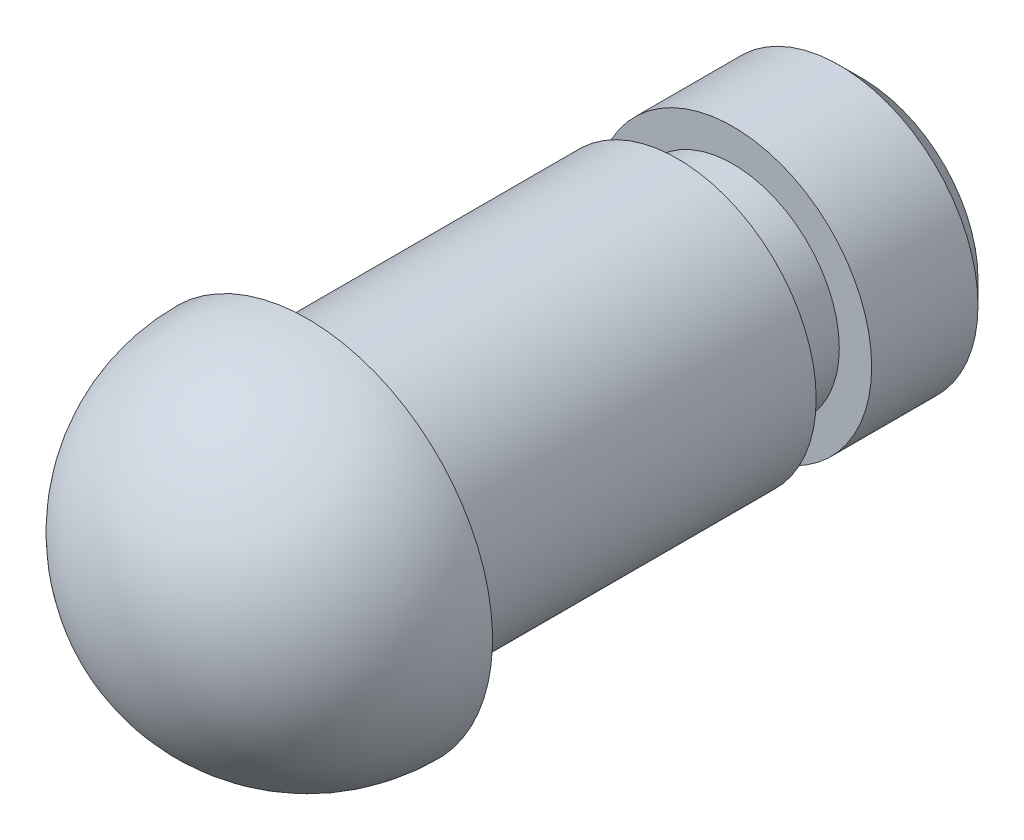
ISO-10303-21;
HEADER;
FILE_DESCRIPTION(('STEP AP214'),'2;1');
FILE_NAME('part.step','',(''),(''),'','','');
FILE_SCHEMA(('AUTOMOTIVE_DESIGN { 1 0 10303 214 1 1 1 1 }'));
ENDSEC;
DATA;
#1=APPLICATION_CONTEXT('core data for automotive mechanical design processes');
#2=APPLICATION_PROTOCOL_DEFINITION('international standard','automotive_design',2000,#1);
#3=PRODUCT_CONTEXT('',#1,'mechanical');
#4=PRODUCT('Part','Part','',(#3));
#5=PRODUCT_RELATED_PRODUCT_CATEGORY('part','',(#4));
#6=PRODUCT_DEFINITION_FORMATION('','',#4);
#7=PRODUCT_DEFINITION_CONTEXT('part definition',#1,'design');
#8=PRODUCT_DEFINITION('design','',#6,#7);
#9=PRODUCT_DEFINITION_SHAPE('','',#8);
#10=(LENGTH_UNIT() NAMED_UNIT(*) SI_UNIT(.MILLI.,.METRE.));
#11=(NAMED_UNIT(*) PLANE_ANGLE_UNIT() SI_UNIT($,.RADIAN.));
#12=(NAMED_UNIT(*) SI_UNIT($,.STERADIAN.) SOLID_ANGLE_UNIT());
#13=UNCERTAINTY_MEASURE_WITH_UNIT(LENGTH_MEASURE(1.E-05),#10,'distance_accuracy_value','');
#14=(GEOMETRIC_REPRESENTATION_CONTEXT(3) GLOBAL_UNCERTAINTY_ASSIGNED_CONTEXT((#13)) GLOBAL_UNIT_ASSIGNED_CONTEXT((#10,
#11,#12)) REPRESENTATION_CONTEXT('',''));
#15=CARTESIAN_POINT('',(0.,0.,0.));
#16=DIRECTION('',(0.,0.,1.));
#17=DIRECTION('',(1.,0.,0.));
#18=AXIS2_PLACEMENT_3D('',#15,#16,#17);
#19=CARTESIAN_POINT('',(0.,0.,1.4));
#20=DIRECTION('',(0.,0.,-1.));
#21=DIRECTION('',(-1.,0.,0.));
#22=AXIS2_PLACEMENT_3D('',#19,#20,#21);
#23=CYLINDRICAL_SURFACE('',#22,1.5);
#24=CARTESIAN_POINT('',(0.,0.,0.25));
#25=DIRECTION('',(0.,0.,1.));
#26=DIRECTION('',(1.,0.,0.));
#27=AXIS2_PLACEMENT_3D('',#24,#25,#26);
#28=CIRCLE('',#27,1.5);
#29=CARTESIAN_POINT('',(1.5,0.,0.25));
#30=VERTEX_POINT('',#29);
#31=EDGE_CURVE('E63',#30,#30,#28,.T.);
#32=ORIENTED_EDGE('',*,*,#31,.T.);
#33=EDGE_LOOP('',(#32));
#34=FACE_BOUND('',#33,.T.);
#35=CARTESIAN_POINT('',(0.,0.,1.4));
#36=DIRECTION('',(0.,0.,1.));
#37=DIRECTION('',(1.,0.,0.));
#38=AXIS2_PLACEMENT_3D('',#35,#36,#37);
#39=CIRCLE('',#38,1.5);
#40=CARTESIAN_POINT('',(1.5,0.,1.4));
#41=VERTEX_POINT('',#40);
#42=EDGE_CURVE('E75',#41,#41,#39,.T.);
#43=ORIENTED_EDGE('',*,*,#42,.F.);
#44=EDGE_LOOP('',(#43));
#45=FACE_BOUND('',#44,.T.);
#46=ADVANCED_FACE('F54',(#34,#45),#23,.T.);
#47=CARTESIAN_POINT('',(0.,0.,1.4));
#48=DIRECTION('',(0.,0.,1.));
#49=DIRECTION('',(1.,0.,0.));
#50=AXIS2_PLACEMENT_3D('',#47,#48,#49);
#51=PLANE('',#50);
#52=CARTESIAN_POINT('',(0.,0.,1.4));
#53=DIRECTION('',(0.,0.,1.));
#54=DIRECTION('',(1.,0.,0.));
#55=AXIS2_PLACEMENT_3D('',#52,#53,#54);
#56=CIRCLE('',#55,1.15);
#57=CARTESIAN_POINT('',(1.15,0.,1.4));
#58=VERTEX_POINT('',#57);
#59=EDGE_CURVE('E69',#58,#58,#56,.T.);
#60=ORIENTED_EDGE('',*,*,#59,.F.);
#61=EDGE_LOOP('',(#60));
#62=FACE_BOUND('',#61,.T.);
#63=ORIENTED_EDGE('',*,*,#42,.T.);
#64=EDGE_LOOP('',(#63));
#65=FACE_BOUND('',#64,.T.);
#66=ADVANCED_FACE('F115',(#62,#65),#51,.T.);
#67=CARTESIAN_POINT('',(0.,0.,0.));
#68=DIRECTION('',(0.,0.,1.));
#69=DIRECTION('',(1.,0.,0.));
#70=AXIS2_PLACEMENT_3D('',#67,#68,#69);
#71=PLANE('',#70);
#72=CARTESIAN_POINT('',(0.,0.,0.));
#73=DIRECTION('',(0.,0.,1.));
#74=DIRECTION('',(1.,0.,0.));
#75=AXIS2_PLACEMENT_3D('',#72,#73,#74);
#76=CIRCLE('',#75,1.25);
#77=CARTESIAN_POINT('',(1.25,0.,0.));
#78=VERTEX_POINT('',#77);
#79=EDGE_CURVE('E12',#78,#78,#76,.F.);
#80=ORIENTED_EDGE('',*,*,#79,.T.);
#81=EDGE_LOOP('',(#80));
#82=FACE_BOUND('',#81,.T.);
#83=ADVANCED_FACE('F119',(#82),#71,.F.);
#84=CARTESIAN_POINT('',(0.,0.,2.));
#85=DIRECTION('',(0.,0.,-1.));
#86=DIRECTION('',(-1.,0.,0.));
#87=AXIS2_PLACEMENT_3D('',#84,#85,#86);
#88=CYLINDRICAL_SURFACE('',#87,1.15);
#89=CARTESIAN_POINT('',(0.,0.,2.));
#90=DIRECTION('',(0.,0.,1.));
#91=DIRECTION('',(1.,0.,0.));
#92=AXIS2_PLACEMENT_3D('',#89,#90,#91);
#93=CIRCLE('',#92,1.15);
#94=CARTESIAN_POINT('',(1.15,0.,2.));
#95=VERTEX_POINT('',#94);
#96=EDGE_CURVE('E80',#95,#95,#93,.T.);
#97=ORIENTED_EDGE('',*,*,#96,.F.);
#98=EDGE_LOOP('',(#97));
#99=FACE_BOUND('',#98,.T.);
#100=ORIENTED_EDGE('',*,*,#59,.T.);
#101=EDGE_LOOP('',(#100));
#102=FACE_BOUND('',#101,.T.);
#103=ADVANCED_FACE('F125',(#99,#102),#88,.T.);
#104=CARTESIAN_POINT('',(0.,0.,6.));
#105=DIRECTION('',(0.,0.,-1.));
#106=DIRECTION('',(-1.,0.,0.));
#107=AXIS2_PLACEMENT_3D('',#104,#105,#106);
#108=CYLINDRICAL_SURFACE('',#107,1.5);
#109=CARTESIAN_POINT('',(0.,0.,6.));
#110=DIRECTION('',(0.,0.,1.));
#111=DIRECTION('',(1.,0.,0.));
#112=AXIS2_PLACEMENT_3D('',#109,#110,#111);
#113=CIRCLE('',#112,1.5);
#114=CARTESIAN_POINT('',(1.5,0.,6.));
#115=VERTEX_POINT('',#114);
#116=EDGE_CURVE('E85',#115,#115,#113,.T.);
#117=ORIENTED_EDGE('',*,*,#116,.F.);
#118=EDGE_LOOP('',(#117));
#119=FACE_BOUND('',#118,.T.);
#120=CARTESIAN_POINT('',(0.,0.,2.));
#121=DIRECTION('',(0.,0.,1.));
#122=DIRECTION('',(1.,0.,0.));
#123=AXIS2_PLACEMENT_3D('',#120,#121,#122);
#124=CIRCLE('',#123,1.5);
#125=CARTESIAN_POINT('',(1.5,0.,2.));
#126=VERTEX_POINT('',#125);
#127=EDGE_CURVE('E86',#126,#126,#124,.T.);
#128=ORIENTED_EDGE('',*,*,#127,.T.);
#129=EDGE_LOOP('',(#128));
#130=FACE_BOUND('',#129,.T.);
#131=ADVANCED_FACE('F111',(#119,#130),#108,.T.);
#132=CARTESIAN_POINT('',(0.,0.,2.));
#133=DIRECTION('',(0.,0.,1.));
#134=DIRECTION('',(1.,0.,0.));
#135=AXIS2_PLACEMENT_3D('',#132,#133,#134);
#136=PLANE('',#135);
#137=ORIENTED_EDGE('',*,*,#96,.T.);
#138=EDGE_LOOP('',(#137));
#139=FACE_BOUND('',#138,.T.);
#140=ORIENTED_EDGE('',*,*,#127,.F.);
#141=EDGE_LOOP('',(#140));
#142=FACE_BOUND('',#141,.T.);
#143=ADVANCED_FACE('F103',(#139,#142),#136,.F.);
#144=CARTESIAN_POINT('',(0.,0.,6.));
#145=DIRECTION('',(0.,1.,0.));
#146=DIRECTION('',(-1.,0.,0.));
#147=AXIS2_PLACEMENT_3D('',#144,#145,#146);
#148=SPHERICAL_SURFACE('',#147,2.);
#149=CARTESIAN_POINT('',(0.,0.,6.));
#150=DIRECTION('',(0.,0.,-1.));
#151=DIRECTION('',(-1.,0.,0.));
#152=AXIS2_PLACEMENT_3D('',#149,#150,#151);
#153=SPHERICAL_SURFACE('',#152,2.);
#154=CARTESIAN_POINT('',(0.,0.,6.));
#155=DIRECTION('',(0.,0.,-1.));
#156=DIRECTION('',(-1.,0.,0.));
#157=AXIS2_PLACEMENT_3D('',#154,#155,#156);
#158=CIRCLE('',#157,2.);
#159=CARTESIAN_POINT('',(-2.,0.,5.99999999999999));
#160=VERTEX_POINT('',#159);
#161=EDGE_CURVE('E90',#160,#160,#158,.T.);
#162=ORIENTED_EDGE('',*,*,#161,.F.);
#163=EDGE_LOOP('',(#162));
#164=FACE_BOUND('',#163,.T.);
#165=ADVANCED_FACE('F101',(#164),#153,.T.);
#166=CARTESIAN_POINT('',(0.,0.,6.));
#167=DIRECTION('',(0.,0.,-1.));
#168=DIRECTION('',(-1.,0.,0.));
#169=AXIS2_PLACEMENT_3D('',#166,#167,#168);
#170=PLANE('',#169);
#171=ORIENTED_EDGE('',*,*,#116,.T.);
#172=EDGE_LOOP('',(#171));
#173=FACE_BOUND('',#172,.T.);
#174=ORIENTED_EDGE('',*,*,#161,.T.);
#175=EDGE_LOOP('',(#174));
#176=FACE_BOUND('',#175,.T.);
#177=ADVANCED_FACE('F99',(#173,#176),#170,.T.);
#178=CARTESIAN_POINT('',(0.,0.,0.25));
#179=DIRECTION('',(0.,0.,1.));
#180=DIRECTION('',(1.,0.,0.));
#181=AXIS2_PLACEMENT_3D('',#178,#179,#180);
#182=CONICAL_SURFACE('',#181,1.5,0.785398163397452);
#183=ORIENTED_EDGE('',*,*,#79,.F.);
#184=EDGE_LOOP('',(#183));
#185=FACE_BOUND('',#184,.T.);
#186=ORIENTED_EDGE('',*,*,#31,.F.);
#187=EDGE_LOOP('',(#186));
#188=FACE_BOUND('',#187,.T.);
#189=ADVANCED_FACE('F57',(#185,#188),#182,.T.);
#190=CLOSED_SHELL('',(#46,#66,#83,#103,#131,#143,#165,#177,#189));
#191=MANIFOLD_SOLID_BREP('B2',#190);
#192=ADVANCED_BREP_SHAPE_REPRESENTATION('',(#18,#191),#14);
#193=SHAPE_DEFINITION_REPRESENTATION(#9,#192);
ENDSEC;
END-ISO-10303-21;
